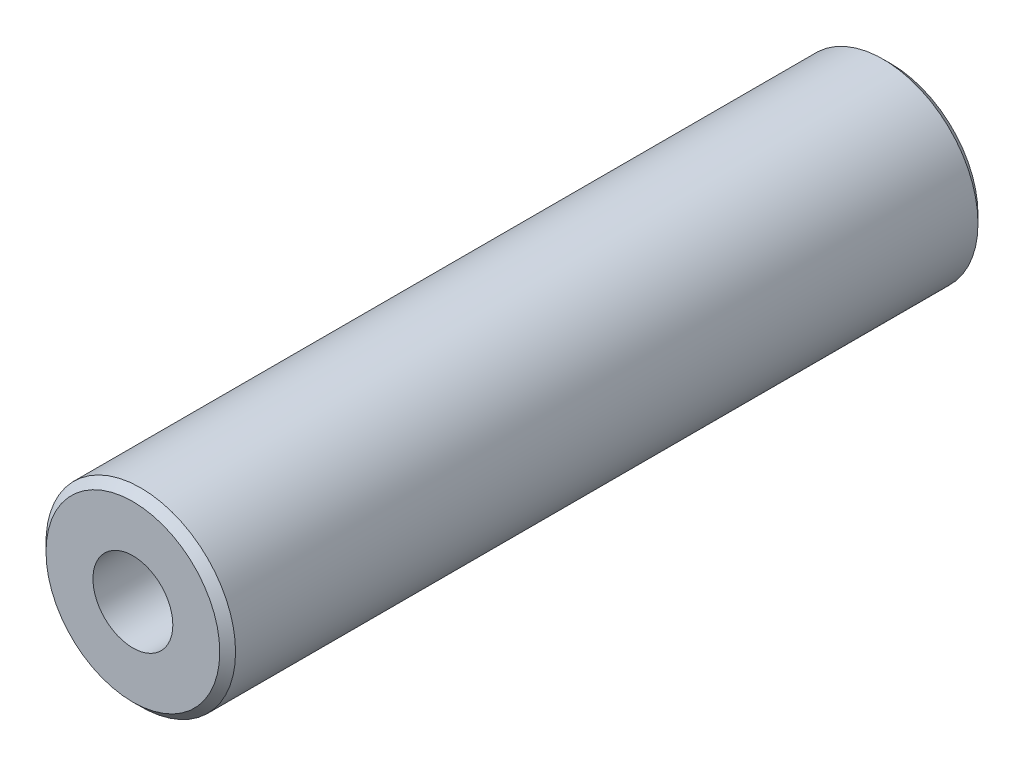
ISO-10303-21;
HEADER;
FILE_DESCRIPTION(('STEP AP214'),'2;1');
FILE_NAME('part.step','',(''),(''),'','','');
FILE_SCHEMA(('AUTOMOTIVE_DESIGN { 1 0 10303 214 1 1 1 1 }'));
ENDSEC;
DATA;
#1=APPLICATION_CONTEXT('core data for automotive mechanical design processes');
#2=APPLICATION_PROTOCOL_DEFINITION('international standard','automotive_design',2000,#1);
#3=PRODUCT_CONTEXT('',#1,'mechanical');
#4=PRODUCT('Part','Part','',(#3));
#5=PRODUCT_RELATED_PRODUCT_CATEGORY('part','',(#4));
#6=PRODUCT_DEFINITION_FORMATION('','',#4);
#7=PRODUCT_DEFINITION_CONTEXT('part definition',#1,'design');
#8=PRODUCT_DEFINITION('design','',#6,#7);
#9=PRODUCT_DEFINITION_SHAPE('','',#8);
#10=(LENGTH_UNIT() NAMED_UNIT(*) SI_UNIT(.MILLI.,.METRE.));
#11=(NAMED_UNIT(*) PLANE_ANGLE_UNIT() SI_UNIT($,.RADIAN.));
#12=(NAMED_UNIT(*) SI_UNIT($,.STERADIAN.) SOLID_ANGLE_UNIT());
#13=UNCERTAINTY_MEASURE_WITH_UNIT(LENGTH_MEASURE(1.E-05),#10,'distance_accuracy_value','');
#14=(GEOMETRIC_REPRESENTATION_CONTEXT(3) GLOBAL_UNCERTAINTY_ASSIGNED_CONTEXT((#13)) GLOBAL_UNIT_ASSIGNED_CONTEXT((#10,
#11,#12)) REPRESENTATION_CONTEXT('',''));
#15=CARTESIAN_POINT('',(0.,0.,0.));
#16=DIRECTION('',(0.,0.,1.));
#17=DIRECTION('',(1.,0.,0.));
#18=AXIS2_PLACEMENT_3D('',#15,#16,#17);
#19=CARTESIAN_POINT('',(0.,0.,0.));
#20=DIRECTION('',(0.,0.,1.));
#21=DIRECTION('',(1.,0.,0.));
#22=AXIS2_PLACEMENT_3D('',#19,#20,#21);
#23=CYLINDRICAL_SURFACE('',#22,1.2645);
#24=CARTESIAN_POINT('',(0.,0.,0.));
#25=DIRECTION('',(0.,0.,1.));
#26=DIRECTION('',(1.,0.,0.));
#27=AXIS2_PLACEMENT_3D('',#24,#25,#26);
#28=CIRCLE('',#27,1.2645);
#29=CARTESIAN_POINT('',(1.2645,0.,0.));
#30=VERTEX_POINT('',#29);
#31=EDGE_CURVE('E33',#30,#30,#28,.F.);
#32=ORIENTED_EDGE('',*,*,#31,.T.);
#33=EDGE_LOOP('',(#32));
#34=FACE_BOUND('',#33,.T.);
#35=CARTESIAN_POINT('',(0.,0.,24.));
#36=DIRECTION('',(0.,0.,1.));
#37=DIRECTION('',(1.,0.,0.));
#38=AXIS2_PLACEMENT_3D('',#35,#36,#37);
#39=CIRCLE('',#38,1.2645);
#40=CARTESIAN_POINT('',(1.2645,0.,24.));
#41=VERTEX_POINT('',#40);
#42=EDGE_CURVE('E17',#41,#41,#39,.F.);
#43=ORIENTED_EDGE('',*,*,#42,.F.);
#44=EDGE_LOOP('',(#43));
#45=FACE_BOUND('',#44,.T.);
#46=ADVANCED_FACE('F14',(#34,#45),#23,.F.);
#47=CARTESIAN_POINT('',(0.,0.,24.));
#48=DIRECTION('',(0.,0.,1.));
#49=DIRECTION('',(1.,0.,0.));
#50=AXIS2_PLACEMENT_3D('',#47,#48,#49);
#51=PLANE('',#50);
#52=ORIENTED_EDGE('',*,*,#42,.T.);
#53=EDGE_LOOP('',(#52));
#54=FACE_BOUND('',#53,.T.);
#55=CARTESIAN_POINT('',(0.,0.,23.9999999999441));
#56=DIRECTION('',(0.,0.,-1.));
#57=DIRECTION('',(0.,1.,0.));
#58=AXIS2_PLACEMENT_3D('',#55,#56,#57);
#59=CIRCLE('',#58,2.74999999999181);
#60=CARTESIAN_POINT('',(0.,2.74999999999181,23.9999999999441));
#61=VERTEX_POINT('',#60);
#62=EDGE_CURVE('E31',#61,#61,#59,.T.);
#63=ORIENTED_EDGE('',*,*,#62,.F.);
#64=EDGE_LOOP('',(#63));
#65=FACE_BOUND('',#64,.T.);
#66=ADVANCED_FACE('F40',(#54,#65),#51,.T.);
#67=CARTESIAN_POINT('',(0.,0.,0.));
#68=DIRECTION('',(0.,0.,1.));
#69=DIRECTION('',(1.,0.,0.));
#70=AXIS2_PLACEMENT_3D('',#67,#68,#69);
#71=PLANE('',#70);
#72=ORIENTED_EDGE('',*,*,#31,.F.);
#73=EDGE_LOOP('',(#72));
#74=FACE_BOUND('',#73,.T.);
#75=CARTESIAN_POINT('',(0.,0.,0.));
#76=DIRECTION('',(0.,0.,1.));
#77=DIRECTION('',(1.,0.,0.));
#78=AXIS2_PLACEMENT_3D('',#75,#76,#77);
#79=CIRCLE('',#78,2.74999999999181);
#80=CARTESIAN_POINT('',(2.74999999999181,0.,0.));
#81=VERTEX_POINT('',#80);
#82=EDGE_CURVE('E26',#81,#81,#79,.T.);
#83=ORIENTED_EDGE('',*,*,#82,.F.);
#84=EDGE_LOOP('',(#83));
#85=FACE_BOUND('',#84,.T.);
#86=ADVANCED_FACE('F48',(#74,#85),#71,.F.);
#87=CARTESIAN_POINT('',(0.,0.,23.74999999995));
#88=DIRECTION('',(0.,0.,-1.));
#89=DIRECTION('',(0.,1.,0.));
#90=AXIS2_PLACEMENT_3D('',#87,#88,#89);
#91=CONICAL_SURFACE('',#90,2.9999999999859,0.785398163397448);
#92=CARTESIAN_POINT('',(0.,0.,23.75));
#93=DIRECTION('',(0.,0.,1.));
#94=DIRECTION('',(1.,0.,0.));
#95=AXIS2_PLACEMENT_3D('',#92,#93,#94);
#96=CIRCLE('',#95,3.);
#97=CARTESIAN_POINT('',(3.,0.,23.75));
#98=VERTEX_POINT('',#97);
#99=EDGE_CURVE('E21',#98,#98,#96,.F.);
#100=ORIENTED_EDGE('',*,*,#99,.F.);
#101=EDGE_LOOP('',(#100));
#102=FACE_BOUND('',#101,.T.);
#103=ORIENTED_EDGE('',*,*,#62,.T.);
#104=EDGE_LOOP('',(#103));
#105=FACE_BOUND('',#104,.T.);
#106=ADVANCED_FACE('F56',(#102,#105),#91,.T.);
#107=CARTESIAN_POINT('',(0.,0.,0.249999999994088));
#108=DIRECTION('',(0.,0.,1.));
#109=DIRECTION('',(1.,0.,0.));
#110=AXIS2_PLACEMENT_3D('',#107,#108,#109);
#111=CONICAL_SURFACE('',#110,2.9999999999859,0.785398163397448);
#112=ORIENTED_EDGE('',*,*,#82,.T.);
#113=EDGE_LOOP('',(#112));
#114=FACE_BOUND('',#113,.T.);
#115=CARTESIAN_POINT('',(0.,0.,0.25));
#116=DIRECTION('',(0.,0.,1.));
#117=DIRECTION('',(1.,0.,0.));
#118=AXIS2_PLACEMENT_3D('',#115,#116,#117);
#119=CIRCLE('',#118,3.);
#120=CARTESIAN_POINT('',(3.,0.,0.25));
#121=VERTEX_POINT('',#120);
#122=EDGE_CURVE('E10',#121,#121,#119,.T.);
#123=ORIENTED_EDGE('',*,*,#122,.F.);
#124=EDGE_LOOP('',(#123));
#125=FACE_BOUND('',#124,.T.);
#126=ADVANCED_FACE('F51',(#114,#125),#111,.T.);
#127=CARTESIAN_POINT('',(0.,0.,0.));
#128=DIRECTION('',(0.,0.,1.));
#129=DIRECTION('',(1.,0.,0.));
#130=AXIS2_PLACEMENT_3D('',#127,#128,#129);
#131=CYLINDRICAL_SURFACE('',#130,3.);
#132=ORIENTED_EDGE('',*,*,#122,.T.);
#133=EDGE_LOOP('',(#132));
#134=FACE_BOUND('',#133,.T.);
#135=ORIENTED_EDGE('',*,*,#99,.T.);
#136=EDGE_LOOP('',(#135));
#137=FACE_BOUND('',#136,.T.);
#138=ADVANCED_FACE('F49',(#134,#137),#131,.T.);
#139=CLOSED_SHELL('',(#46,#66,#86,#106,#126,#138));
#140=MANIFOLD_SOLID_BREP('B1',#139);
#141=ADVANCED_BREP_SHAPE_REPRESENTATION('',(#18,#140),#14);
#142=SHAPE_DEFINITION_REPRESENTATION(#9,#141);
ENDSEC;
END-ISO-10303-21;
